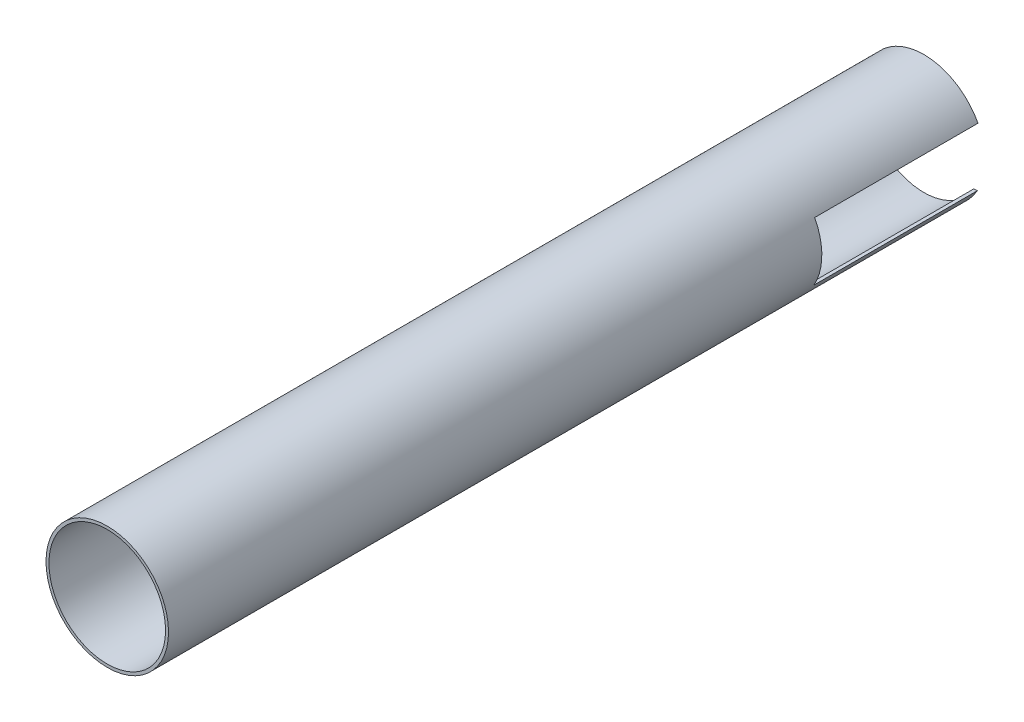
ISO-10303-21;
HEADER;
FILE_DESCRIPTION(('STEP AP214'),'2;1');
FILE_NAME('part.step','',(''),(''),'','','');
FILE_SCHEMA(('AUTOMOTIVE_DESIGN { 1 0 10303 214 1 1 1 1 }'));
ENDSEC;
DATA;
#1=APPLICATION_CONTEXT('core data for automotive mechanical design processes');
#2=APPLICATION_PROTOCOL_DEFINITION('international standard','automotive_design',2000,#1);
#3=PRODUCT_CONTEXT('',#1,'mechanical');
#4=PRODUCT('Part','Part','',(#3));
#5=PRODUCT_RELATED_PRODUCT_CATEGORY('part','',(#4));
#6=PRODUCT_DEFINITION_FORMATION('','',#4);
#7=PRODUCT_DEFINITION_CONTEXT('part definition',#1,'design');
#8=PRODUCT_DEFINITION('design','',#6,#7);
#9=PRODUCT_DEFINITION_SHAPE('','',#8);
#10=(LENGTH_UNIT() NAMED_UNIT(*) SI_UNIT(.MILLI.,.METRE.));
#11=(NAMED_UNIT(*) PLANE_ANGLE_UNIT() SI_UNIT($,.RADIAN.));
#12=(NAMED_UNIT(*) SI_UNIT($,.STERADIAN.) SOLID_ANGLE_UNIT());
#13=UNCERTAINTY_MEASURE_WITH_UNIT(LENGTH_MEASURE(1.E-05),#10,'distance_accuracy_value','');
#14=(GEOMETRIC_REPRESENTATION_CONTEXT(3) GLOBAL_UNCERTAINTY_ASSIGNED_CONTEXT((#13)) GLOBAL_UNIT_ASSIGNED_CONTEXT((#10,
#11,#12)) REPRESENTATION_CONTEXT('',''));
#15=CARTESIAN_POINT('',(0.,0.,0.));
#16=DIRECTION('',(0.,0.,1.));
#17=DIRECTION('',(1.,0.,0.));
#18=AXIS2_PLACEMENT_3D('',#15,#16,#17);
#19=CARTESIAN_POINT('',(0.,0.,500.));
#20=DIRECTION('',(0.,0.,-1.));
#21=DIRECTION('',(-1.,0.,0.));
#22=AXIS2_PLACEMENT_3D('',#19,#20,#21);
#23=CYLINDRICAL_SURFACE('',#22,37.5);
#24=CARTESIAN_POINT('',(0.,0.,500.));
#25=DIRECTION('',(0.,0.,1.));
#26=DIRECTION('',(1.,0.,0.));
#27=AXIS2_PLACEMENT_3D('',#24,#25,#26);
#28=CIRCLE('',#27,37.5);
#29=CARTESIAN_POINT('',(37.5,0.,500.));
#30=VERTEX_POINT('',#29);
#31=EDGE_CURVE('E128',#30,#30,#28,.T.);
#32=ORIENTED_EDGE('',*,*,#31,.F.);
#33=EDGE_LOOP('',(#32));
#34=FACE_BOUND('',#33,.T.);
#35=DIRECTION('',(0.,0.,-1.));
#36=VECTOR('',#35,1.);
#37=CARTESIAN_POINT('',(32.6865053261974,-18.3804888281152,500.));
#38=LINE('',#37,#36);
#39=CARTESIAN_POINT('',(32.6865053261974,-18.3804888281152,100.));
#40=VERTEX_POINT('',#39);
#41=CARTESIAN_POINT('',(32.6865053261974,-18.3804888281152,0.));
#42=VERTEX_POINT('',#41);
#43=EDGE_CURVE('E181',#40,#42,#38,.T.);
#44=ORIENTED_EDGE('',*,*,#43,.F.);
#45=CARTESIAN_POINT('',(0.,0.,100.));
#46=DIRECTION('',(0.,0.,-1.));
#47=DIRECTION('',(-1.,0.,0.));
#48=AXIS2_PLACEMENT_3D('',#45,#46,#47);
#49=CIRCLE('',#48,37.5);
#50=CARTESIAN_POINT('',(33.1029126522702,17.6195111718848,100.));
#51=VERTEX_POINT('',#50);
#52=EDGE_CURVE('E187',#51,#40,#49,.T.);
#53=ORIENTED_EDGE('',*,*,#52,.F.);
#54=DIRECTION('',(0.,0.,-1.));
#55=VECTOR('',#54,1.);
#56=CARTESIAN_POINT('',(33.1029126522701,17.6195111718848,500.));
#57=LINE('',#56,#55);
#58=CARTESIAN_POINT('',(33.1029126522702,17.6195111718848,0.));
#59=VERTEX_POINT('',#58);
#60=EDGE_CURVE('E110',#51,#59,#57,.T.);
#61=ORIENTED_EDGE('',*,*,#60,.T.);
#62=CARTESIAN_POINT('',(0.,0.,0.));
#63=DIRECTION('',(0.,0.,1.));
#64=DIRECTION('',(1.,0.,0.));
#65=AXIS2_PLACEMENT_3D('',#62,#63,#64);
#66=CIRCLE('',#65,37.5);
#67=CARTESIAN_POINT('',(-33.1029126522702,17.6195111718848,0.));
#68=VERTEX_POINT('',#67);
#69=EDGE_CURVE('E118',#59,#68,#66,.T.);
#70=ORIENTED_EDGE('',*,*,#69,.T.);
#71=DIRECTION('',(0.,0.,-1.));
#72=VECTOR('',#71,1.);
#73=CARTESIAN_POINT('',(-33.1029126522701,17.6195111718848,500.));
#74=LINE('',#73,#72);
#75=CARTESIAN_POINT('',(-33.1029126522702,17.6195111718848,100.));
#76=VERTEX_POINT('',#75);
#77=EDGE_CURVE('E102',#68,#76,#74,.F.);
#78=ORIENTED_EDGE('',*,*,#77,.T.);
#79=CARTESIAN_POINT('',(-32.6865053261974,-18.3804888281152,100.));
#80=VERTEX_POINT('',#79);
#81=EDGE_CURVE('E188',#80,#76,#49,.T.);
#82=ORIENTED_EDGE('',*,*,#81,.F.);
#83=DIRECTION('',(0.,0.,-1.));
#84=VECTOR('',#83,1.);
#85=CARTESIAN_POINT('',(-32.6865053261974,-18.3804888281152,500.));
#86=LINE('',#85,#84);
#87=CARTESIAN_POINT('',(-32.6865053261974,-18.3804888281152,0.));
#88=VERTEX_POINT('',#87);
#89=EDGE_CURVE('E162',#88,#80,#86,.F.);
#90=ORIENTED_EDGE('',*,*,#89,.F.);
#91=EDGE_CURVE('E129',#88,#42,#66,.T.);
#92=ORIENTED_EDGE('',*,*,#91,.T.);
#93=EDGE_LOOP('',(#44,#53,#61,#70,#78,#82,#90,#92));
#94=FACE_BOUND('',#93,.T.);
#95=ADVANCED_FACE('F39',(#34,#94),#23,.T.);
#96=CARTESIAN_POINT('',(0.,0.,0.));
#97=DIRECTION('',(0.,0.,1.));
#98=DIRECTION('',(1.,0.,0.));
#99=AXIS2_PLACEMENT_3D('',#96,#97,#98);
#100=PLANE('',#99);
#101=DIRECTION('',(1.,0.,0.));
#102=VECTOR('',#101,1.);
#103=CARTESIAN_POINT('',(-500.,-18.3804888281152,0.));
#104=LINE('',#103,#102);
#105=CARTESIAN_POINT('',(30.6046994829149,-18.3804888281152,0.));
#106=VERTEX_POINT('',#105);
#107=EDGE_CURVE('E164',#106,#42,#104,.T.);
#108=ORIENTED_EDGE('',*,*,#107,.T.);
#109=ORIENTED_EDGE('',*,*,#91,.F.);
#110=CARTESIAN_POINT('',(-30.6046994829149,-18.3804888281152,0.));
#111=VERTEX_POINT('',#110);
#112=EDGE_CURVE('E111',#88,#111,#104,.T.);
#113=ORIENTED_EDGE('',*,*,#112,.T.);
#114=CARTESIAN_POINT('',(0.,0.,0.));
#115=DIRECTION('',(0.,0.,1.));
#116=DIRECTION('',(1.,0.,0.));
#117=AXIS2_PLACEMENT_3D('',#114,#115,#116);
#118=CIRCLE('',#117,35.7);
#119=EDGE_CURVE('E171',#111,#106,#118,.T.);
#120=ORIENTED_EDGE('',*,*,#119,.T.);
#121=EDGE_LOOP('',(#108,#109,#113,#120));
#122=FACE_BOUND('',#121,.T.);
#123=ADVANCED_FACE('F206',(#122),#100,.F.);
#124=CARTESIAN_POINT('',(0.,0.,0.));
#125=DIRECTION('',(0.,0.,1.));
#126=DIRECTION('',(1.,0.,0.));
#127=AXIS2_PLACEMENT_3D('',#124,#125,#126);
#128=CYLINDRICAL_SURFACE('',#127,35.7);
#129=CARTESIAN_POINT('',(0.,0.,500.));
#130=DIRECTION('',(0.,0.,1.));
#131=DIRECTION('',(1.,0.,0.));
#132=AXIS2_PLACEMENT_3D('',#129,#130,#131);
#133=CIRCLE('',#132,35.7);
#134=CARTESIAN_POINT('',(35.7,0.,500.));
#135=VERTEX_POINT('',#134);
#136=EDGE_CURVE('E176',#135,#135,#133,.T.);
#137=ORIENTED_EDGE('',*,*,#136,.T.);
#138=EDGE_LOOP('',(#137));
#139=FACE_BOUND('',#138,.T.);
#140=DIRECTION('',(0.,0.,1.));
#141=VECTOR('',#140,1.);
#142=CARTESIAN_POINT('',(-30.6046994829149,-18.3804888281152,0.));
#143=LINE('',#142,#141);
#144=CARTESIAN_POINT('',(-30.6046994829149,-18.3804888281152,100.));
#145=VERTEX_POINT('',#144);
#146=EDGE_CURVE('E11',#145,#111,#143,.F.);
#147=ORIENTED_EDGE('',*,*,#146,.F.);
#148=CARTESIAN_POINT('',(0.,0.,100.));
#149=DIRECTION('',(0.,0.,-1.));
#150=DIRECTION('',(-1.,0.,0.));
#151=AXIS2_PLACEMENT_3D('',#148,#149,#150);
#152=CIRCLE('',#151,35.7);
#153=CARTESIAN_POINT('',(-31.0490390521805,17.6195111718848,100.));
#154=VERTEX_POINT('',#153);
#155=EDGE_CURVE('E47',#154,#145,#152,.F.);
#156=ORIENTED_EDGE('',*,*,#155,.F.);
#157=DIRECTION('',(0.,0.,1.));
#158=VECTOR('',#157,1.);
#159=CARTESIAN_POINT('',(-31.0490390521805,17.6195111718848,0.));
#160=LINE('',#159,#158);
#161=CARTESIAN_POINT('',(-31.0490390521805,17.6195111718848,0.));
#162=VERTEX_POINT('',#161);
#163=EDGE_CURVE('E147',#154,#162,#160,.F.);
#164=ORIENTED_EDGE('',*,*,#163,.T.);
#165=CARTESIAN_POINT('',(31.0490390521805,17.6195111718848,0.));
#166=VERTEX_POINT('',#165);
#167=EDGE_CURVE('E120',#166,#162,#118,.T.);
#168=ORIENTED_EDGE('',*,*,#167,.F.);
#169=DIRECTION('',(0.,0.,1.));
#170=VECTOR('',#169,1.);
#171=CARTESIAN_POINT('',(31.0490390521805,17.6195111718848,0.));
#172=LINE('',#171,#170);
#173=CARTESIAN_POINT('',(31.0490390521805,17.6195111718848,100.));
#174=VERTEX_POINT('',#173);
#175=EDGE_CURVE('E134',#166,#174,#172,.T.);
#176=ORIENTED_EDGE('',*,*,#175,.T.);
#177=CARTESIAN_POINT('',(30.6046994829149,-18.3804888281152,100.));
#178=VERTEX_POINT('',#177);
#179=EDGE_CURVE('E142',#178,#174,#152,.F.);
#180=ORIENTED_EDGE('',*,*,#179,.F.);
#181=DIRECTION('',(0.,0.,1.));
#182=VECTOR('',#181,1.);
#183=CARTESIAN_POINT('',(30.6046994829149,-18.3804888281152,0.));
#184=LINE('',#183,#182);
#185=EDGE_CURVE('E145',#106,#178,#184,.T.);
#186=ORIENTED_EDGE('',*,*,#185,.F.);
#187=ORIENTED_EDGE('',*,*,#119,.F.);
#188=EDGE_LOOP('',(#147,#156,#164,#168,#176,#180,#186,#187));
#189=FACE_BOUND('',#188,.T.);
#190=ADVANCED_FACE('F168',(#139,#189),#128,.F.);
#191=CARTESIAN_POINT('',(0.,0.,500.));
#192=DIRECTION('',(0.,0.,1.));
#193=DIRECTION('',(1.,0.,0.));
#194=AXIS2_PLACEMENT_3D('',#191,#192,#193);
#195=PLANE('',#194);
#196=ORIENTED_EDGE('',*,*,#136,.F.);
#197=EDGE_LOOP('',(#196));
#198=FACE_BOUND('',#197,.T.);
#199=ORIENTED_EDGE('',*,*,#31,.T.);
#200=EDGE_LOOP('',(#199));
#201=FACE_BOUND('',#200,.T.);
#202=ADVANCED_FACE('F215',(#198,#201),#195,.T.);
#203=ORIENTED_EDGE('',*,*,#69,.F.);
#204=DIRECTION('',(1.,0.,0.));
#205=VECTOR('',#204,1.);
#206=CARTESIAN_POINT('',(-500.,17.6195111718848,0.));
#207=LINE('',#206,#205);
#208=EDGE_CURVE('E122',#166,#59,#207,.T.);
#209=ORIENTED_EDGE('',*,*,#208,.F.);
#210=ORIENTED_EDGE('',*,*,#167,.T.);
#211=EDGE_CURVE('E62',#68,#162,#207,.T.);
#212=ORIENTED_EDGE('',*,*,#211,.F.);
#213=EDGE_LOOP('',(#203,#209,#210,#212));
#214=FACE_BOUND('',#213,.T.);
#215=ADVANCED_FACE('F116',(#214),#100,.F.);
#216=CARTESIAN_POINT('',(-500.,17.6195111718848,0.));
#217=DIRECTION('',(0.,1.,0.));
#218=DIRECTION('',(0.,0.,1.));
#219=AXIS2_PLACEMENT_3D('',#216,#217,#218);
#220=PLANE('',#219);
#221=DIRECTION('',(1.,0.,0.));
#222=VECTOR('',#221,1.);
#223=CARTESIAN_POINT('',(-500.,17.6195111718848,100.));
#224=LINE('',#223,#222);
#225=EDGE_CURVE('E54',#174,#51,#224,.T.);
#226=ORIENTED_EDGE('',*,*,#225,.F.);
#227=ORIENTED_EDGE('',*,*,#175,.F.);
#228=ORIENTED_EDGE('',*,*,#208,.T.);
#229=ORIENTED_EDGE('',*,*,#60,.F.);
#230=EDGE_LOOP('',(#226,#227,#228,#229));
#231=FACE_BOUND('',#230,.T.);
#232=ADVANCED_FACE('F199',(#231),#220,.F.);
#233=CARTESIAN_POINT('',(-500.,-18.3804888281152,100.));
#234=DIRECTION('',(0.,0.,-1.));
#235=DIRECTION('',(-1.,0.,0.));
#236=AXIS2_PLACEMENT_3D('',#233,#234,#235);
#237=PLANE('',#236);
#238=ORIENTED_EDGE('',*,*,#52,.T.);
#239=DIRECTION('',(1.,0.,0.));
#240=VECTOR('',#239,1.);
#241=CARTESIAN_POINT('',(-500.,-18.3804888281152,100.));
#242=LINE('',#241,#240);
#243=EDGE_CURVE('E165',#178,#40,#242,.T.);
#244=ORIENTED_EDGE('',*,*,#243,.F.);
#245=ORIENTED_EDGE('',*,*,#179,.T.);
#246=ORIENTED_EDGE('',*,*,#225,.T.);
#247=EDGE_LOOP('',(#238,#244,#245,#246));
#248=FACE_BOUND('',#247,.T.);
#249=ADVANCED_FACE('F202',(#248),#237,.T.);
#250=CARTESIAN_POINT('',(-500.,-18.3804888281152,0.));
#251=DIRECTION('',(0.,1.,0.));
#252=DIRECTION('',(0.,0.,1.));
#253=AXIS2_PLACEMENT_3D('',#250,#251,#252);
#254=PLANE('',#253);
#255=ORIENTED_EDGE('',*,*,#43,.T.);
#256=ORIENTED_EDGE('',*,*,#107,.F.);
#257=ORIENTED_EDGE('',*,*,#185,.T.);
#258=ORIENTED_EDGE('',*,*,#243,.T.);
#259=EDGE_LOOP('',(#255,#256,#257,#258));
#260=FACE_BOUND('',#259,.T.);
#261=ADVANCED_FACE('F204',(#260),#254,.T.);
#262=ORIENTED_EDGE('',*,*,#89,.T.);
#263=EDGE_CURVE('E156',#80,#145,#242,.T.);
#264=ORIENTED_EDGE('',*,*,#263,.T.);
#265=ORIENTED_EDGE('',*,*,#146,.T.);
#266=ORIENTED_EDGE('',*,*,#112,.F.);
#267=EDGE_LOOP('',(#262,#264,#265,#266));
#268=FACE_BOUND('',#267,.T.);
#269=ADVANCED_FACE('F159',(#268),#254,.T.);
#270=ORIENTED_EDGE('',*,*,#81,.T.);
#271=EDGE_CURVE('E105',#76,#154,#224,.T.);
#272=ORIENTED_EDGE('',*,*,#271,.T.);
#273=ORIENTED_EDGE('',*,*,#155,.T.);
#274=ORIENTED_EDGE('',*,*,#263,.F.);
#275=EDGE_LOOP('',(#270,#272,#273,#274));
#276=FACE_BOUND('',#275,.T.);
#277=ADVANCED_FACE('F155',(#276),#237,.T.);
#278=ORIENTED_EDGE('',*,*,#211,.T.);
#279=ORIENTED_EDGE('',*,*,#163,.F.);
#280=ORIENTED_EDGE('',*,*,#271,.F.);
#281=ORIENTED_EDGE('',*,*,#77,.F.);
#282=EDGE_LOOP('',(#278,#279,#280,#281));
#283=FACE_BOUND('',#282,.T.);
#284=ADVANCED_FACE('F103',(#283),#220,.F.);
#285=CLOSED_SHELL('',(#95,#123,#190,#202,#215,#232,#249,#261,#269,#277,#284));
#286=MANIFOLD_SOLID_BREP('B2',#285);
#287=ADVANCED_BREP_SHAPE_REPRESENTATION('',(#18,#286),#14);
#288=SHAPE_DEFINITION_REPRESENTATION(#9,#287);
ENDSEC;
END-ISO-10303-21;
